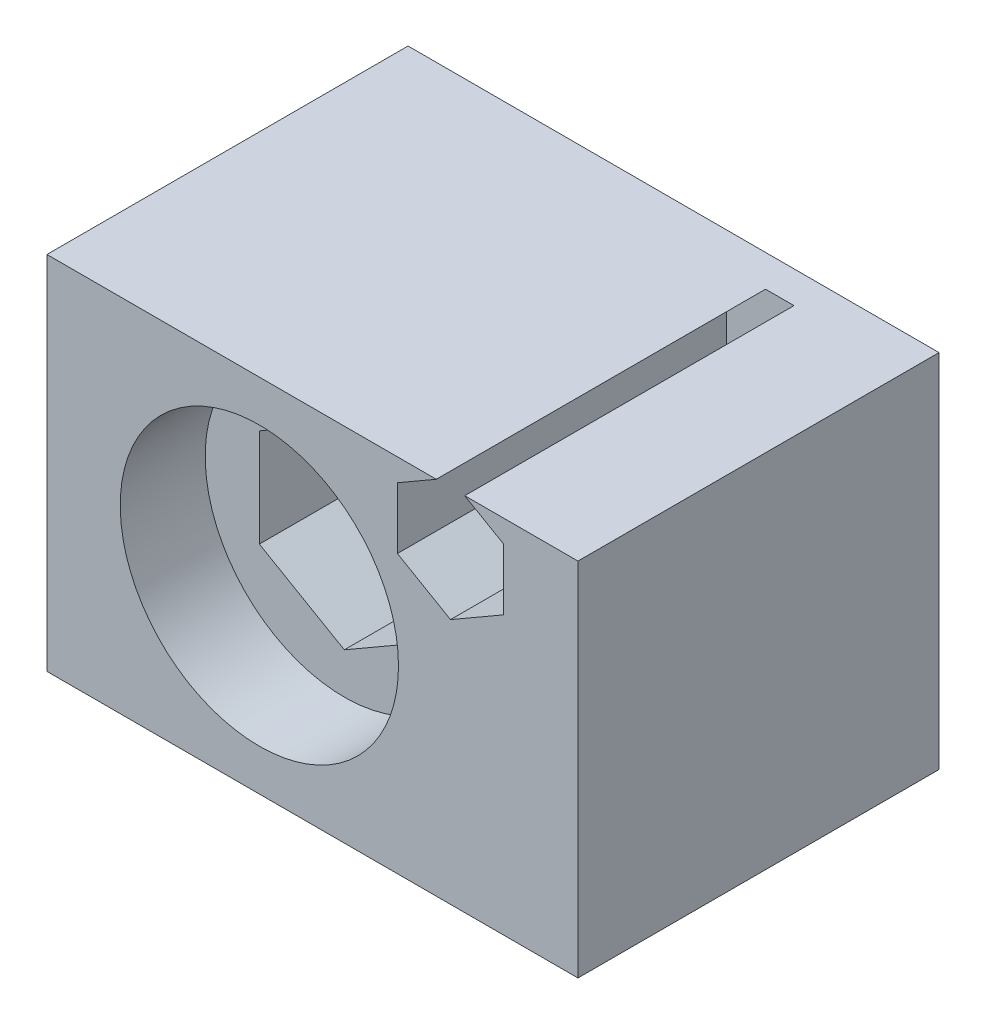
ISO-10303-21;
HEADER;
FILE_DESCRIPTION(('STEP AP214'),'2;1');
FILE_NAME('part.step','',(''),(''),'','','');
FILE_SCHEMA(('AUTOMOTIVE_DESIGN { 1 0 10303 214 1 1 1 1 }'));
ENDSEC;
DATA;
#1=APPLICATION_CONTEXT('core data for automotive mechanical design processes');
#2=APPLICATION_PROTOCOL_DEFINITION('international standard','automotive_design',2000,#1);
#3=PRODUCT_CONTEXT('',#1,'mechanical');
#4=PRODUCT('Part','Part','',(#3));
#5=PRODUCT_RELATED_PRODUCT_CATEGORY('part','',(#4));
#6=PRODUCT_DEFINITION_FORMATION('','',#4);
#7=PRODUCT_DEFINITION_CONTEXT('part definition',#1,'design');
#8=PRODUCT_DEFINITION('design','',#6,#7);
#9=PRODUCT_DEFINITION_SHAPE('','',#8);
#10=(LENGTH_UNIT() NAMED_UNIT(*) SI_UNIT(.MILLI.,.METRE.));
#11=(NAMED_UNIT(*) PLANE_ANGLE_UNIT() SI_UNIT($,.RADIAN.));
#12=(NAMED_UNIT(*) SI_UNIT($,.STERADIAN.) SOLID_ANGLE_UNIT());
#13=UNCERTAINTY_MEASURE_WITH_UNIT(LENGTH_MEASURE(1.E-05),#10,'distance_accuracy_value','');
#14=(GEOMETRIC_REPRESENTATION_CONTEXT(3) GLOBAL_UNCERTAINTY_ASSIGNED_CONTEXT((#13)) GLOBAL_UNIT_ASSIGNED_CONTEXT((#10,
#11,#12)) REPRESENTATION_CONTEXT('',''));
#15=CARTESIAN_POINT('',(0.,0.,0.));
#16=DIRECTION('',(0.,0.,1.));
#17=DIRECTION('',(1.,0.,0.));
#18=AXIS2_PLACEMENT_3D('',#15,#16,#17);
#19=CARTESIAN_POINT('',(10.,9.,-4.5));
#20=DIRECTION('',(0.,0.,1.));
#21=DIRECTION('',(1.,0.,0.));
#22=AXIS2_PLACEMENT_3D('',#19,#20,#21);
#23=CYLINDRICAL_SURFACE('',#22,6.55);
#24=CARTESIAN_POINT('',(10.,9.,-4.5));
#25=DIRECTION('',(0.,0.,1.));
#26=DIRECTION('',(1.,0.,0.));
#27=AXIS2_PLACEMENT_3D('',#24,#25,#26);
#28=CIRCLE('',#27,6.55);
#29=CARTESIAN_POINT('',(16.55,9.,-4.5));
#30=VERTEX_POINT('',#29);
#31=EDGE_CURVE('E283',#30,#30,#28,.T.);
#32=ORIENTED_EDGE('',*,*,#31,.F.);
#33=EDGE_LOOP('',(#32));
#34=FACE_BOUND('',#33,.T.);
#35=CARTESIAN_POINT('',(10.,9.,-0.499999999999999));
#36=DIRECTION('',(0.,0.,1.));
#37=DIRECTION('',(0.,-1.,0.));
#38=AXIS2_PLACEMENT_3D('',#35,#36,#37);
#39=CIRCLE('',#38,6.55);
#40=CARTESIAN_POINT('',(10.,2.45,-0.499999999999997));
#41=VERTEX_POINT('',#40);
#42=EDGE_CURVE('E206',#41,#41,#39,.F.);
#43=ORIENTED_EDGE('',*,*,#42,.F.);
#44=EDGE_LOOP('',(#43));
#45=FACE_BOUND('',#44,.T.);
#46=ADVANCED_FACE('F36',(#34,#45),#23,.F.);
#47=CARTESIAN_POINT('',(10.,9.,-4.5));
#48=DIRECTION('',(0.,0.,1.));
#49=DIRECTION('',(1.,0.,0.));
#50=AXIS2_PLACEMENT_3D('',#47,#48,#49);
#51=PLANE('',#50);
#52=DIRECTION('',(-0.866025403784439,0.5,0.));
#53=VECTOR('',#52,1.);
#54=CARTESIAN_POINT('',(14.,11.3094010767585,-4.5));
#55=LINE('',#54,#53);
#56=CARTESIAN_POINT('',(14.,11.3094010767585,-4.5));
#57=VERTEX_POINT('',#56);
#58=CARTESIAN_POINT('',(10.,13.618802153517,-4.5));
#59=VERTEX_POINT('',#58);
#60=EDGE_CURVE('E230',#57,#59,#55,.T.);
#61=ORIENTED_EDGE('',*,*,#60,.F.);
#62=DIRECTION('',(0.,1.,0.));
#63=VECTOR('',#62,1.);
#64=CARTESIAN_POINT('',(14.,6.6905989232415,-4.5));
#65=LINE('',#64,#63);
#66=CARTESIAN_POINT('',(14.,6.6905989232415,-4.5));
#67=VERTEX_POINT('',#66);
#68=EDGE_CURVE('E267',#67,#57,#65,.T.);
#69=ORIENTED_EDGE('',*,*,#68,.F.);
#70=DIRECTION('',(0.866025403784439,0.5,0.));
#71=VECTOR('',#70,1.);
#72=CARTESIAN_POINT('',(10.,4.381197846483,-4.5));
#73=LINE('',#72,#71);
#74=CARTESIAN_POINT('',(10.,4.381197846483,-4.5));
#75=VERTEX_POINT('',#74);
#76=EDGE_CURVE('E264',#75,#67,#73,.T.);
#77=ORIENTED_EDGE('',*,*,#76,.F.);
#78=DIRECTION('',(0.866025403784439,-0.5,0.));
#79=VECTOR('',#78,1.);
#80=CARTESIAN_POINT('',(6.,6.6905989232415,-4.5));
#81=LINE('',#80,#79);
#82=CARTESIAN_POINT('',(6.,6.6905989232415,-4.5));
#83=VERTEX_POINT('',#82);
#84=EDGE_CURVE('E261',#83,#75,#81,.T.);
#85=ORIENTED_EDGE('',*,*,#84,.F.);
#86=DIRECTION('',(0.,-1.,0.));
#87=VECTOR('',#86,1.);
#88=CARTESIAN_POINT('',(6.,11.3094010767585,-4.5));
#89=LINE('',#88,#87);
#90=CARTESIAN_POINT('',(6.,11.3094010767585,-4.5));
#91=VERTEX_POINT('',#90);
#92=EDGE_CURVE('E258',#91,#83,#89,.T.);
#93=ORIENTED_EDGE('',*,*,#92,.F.);
#94=DIRECTION('',(-0.866025403784438,-0.5,0.));
#95=VECTOR('',#94,1.);
#96=CARTESIAN_POINT('',(10.,13.618802153517,-4.5));
#97=LINE('',#96,#95);
#98=EDGE_CURVE('E255',#59,#91,#97,.T.);
#99=ORIENTED_EDGE('',*,*,#98,.F.);
#100=EDGE_LOOP('',(#61,#69,#77,#85,#93,#99));
#101=FACE_BOUND('',#100,.T.);
#102=ORIENTED_EDGE('',*,*,#31,.T.);
#103=EDGE_LOOP('',(#102));
#104=FACE_BOUND('',#103,.T.);
#105=ADVANCED_FACE('F332',(#101,#104),#51,.T.);
#106=CARTESIAN_POINT('',(14.,11.3094010767585,-30.2202018532156));
#107=DIRECTION('',(0.5,0.866025403784439,0.));
#108=DIRECTION('',(-0.866025403784439,0.5,0.));
#109=AXIS2_PLACEMENT_3D('',#106,#107,#108);
#110=PLANE('',#109);
#111=DIRECTION('',(0.866025403784439,-0.5,0.));
#112=VECTOR('',#111,1.);
#113=CARTESIAN_POINT('',(14.,11.3094010767585,-16.2));
#114=LINE('',#113,#112);
#115=CARTESIAN_POINT('',(10.,13.618802153517,-16.2));
#116=VERTEX_POINT('',#115);
#117=CARTESIAN_POINT('',(14.,11.3094010767585,-16.2));
#118=VERTEX_POINT('',#117);
#119=EDGE_CURVE('E251',#116,#118,#114,.T.);
#120=ORIENTED_EDGE('',*,*,#119,.T.);
#121=DIRECTION('',(0.,0.,1.));
#122=VECTOR('',#121,1.);
#123=CARTESIAN_POINT('',(14.,11.3094010767585,-30.2202018532156));
#124=LINE('',#123,#122);
#125=EDGE_CURVE('E245',#118,#57,#124,.T.);
#126=ORIENTED_EDGE('',*,*,#125,.T.);
#127=ORIENTED_EDGE('',*,*,#60,.T.);
#128=DIRECTION('',(0.,0.,1.));
#129=VECTOR('',#128,1.);
#130=CARTESIAN_POINT('',(10.,13.618802153517,-30.2202018532156));
#131=LINE('',#130,#129);
#132=EDGE_CURVE('E270',#116,#59,#131,.T.);
#133=ORIENTED_EDGE('',*,*,#132,.F.);
#134=EDGE_LOOP('',(#120,#126,#127,#133));
#135=FACE_BOUND('',#134,.T.);
#136=ADVANCED_FACE('F338',(#135),#110,.F.);
#137=CARTESIAN_POINT('',(14.,6.6905989232415,-30.2202018532156));
#138=DIRECTION('',(1.,0.,0.));
#139=DIRECTION('',(0.,0.,-1.));
#140=AXIS2_PLACEMENT_3D('',#137,#138,#139);
#141=PLANE('',#140);
#142=DIRECTION('',(0.,-1.,0.));
#143=VECTOR('',#142,1.);
#144=CARTESIAN_POINT('',(14.,6.6905989232415,-16.2));
#145=LINE('',#144,#143);
#146=CARTESIAN_POINT('',(14.,6.6905989232415,-16.2));
#147=VERTEX_POINT('',#146);
#148=EDGE_CURVE('E249',#118,#147,#145,.T.);
#149=ORIENTED_EDGE('',*,*,#148,.T.);
#150=DIRECTION('',(0.,0.,1.));
#151=VECTOR('',#150,1.);
#152=CARTESIAN_POINT('',(14.,6.6905989232415,-30.2202018532156));
#153=LINE('',#152,#151);
#154=EDGE_CURVE('E272',#147,#67,#153,.T.);
#155=ORIENTED_EDGE('',*,*,#154,.T.);
#156=ORIENTED_EDGE('',*,*,#68,.T.);
#157=ORIENTED_EDGE('',*,*,#125,.F.);
#158=EDGE_LOOP('',(#149,#155,#156,#157));
#159=FACE_BOUND('',#158,.T.);
#160=ADVANCED_FACE('F488',(#159),#141,.F.);
#161=CARTESIAN_POINT('',(10.,4.381197846483,-30.2202018532156));
#162=DIRECTION('',(0.5,-0.866025403784439,0.));
#163=DIRECTION('',(0.866025403784439,0.5,0.));
#164=AXIS2_PLACEMENT_3D('',#161,#162,#163);
#165=PLANE('',#164);
#166=DIRECTION('',(-0.866025403784439,-0.5,0.));
#167=VECTOR('',#166,1.);
#168=CARTESIAN_POINT('',(10.,4.381197846483,-16.2));
#169=LINE('',#168,#167);
#170=CARTESIAN_POINT('',(10.,4.381197846483,-16.2));
#171=VERTEX_POINT('',#170);
#172=EDGE_CURVE('E247',#147,#171,#169,.T.);
#173=ORIENTED_EDGE('',*,*,#172,.T.);
#174=DIRECTION('',(0.,0.,1.));
#175=VECTOR('',#174,1.);
#176=CARTESIAN_POINT('',(10.,4.381197846483,-30.2202018532156));
#177=LINE('',#176,#175);
#178=EDGE_CURVE('E274',#171,#75,#177,.T.);
#179=ORIENTED_EDGE('',*,*,#178,.T.);
#180=ORIENTED_EDGE('',*,*,#76,.T.);
#181=ORIENTED_EDGE('',*,*,#154,.F.);
#182=EDGE_LOOP('',(#173,#179,#180,#181));
#183=FACE_BOUND('',#182,.T.);
#184=ADVANCED_FACE('F480',(#183),#165,.F.);
#185=CARTESIAN_POINT('',(6.,6.6905989232415,-30.2202018532156));
#186=DIRECTION('',(-0.5,-0.866025403784439,0.));
#187=DIRECTION('',(0.866025403784439,-0.5,0.));
#188=AXIS2_PLACEMENT_3D('',#185,#186,#187);
#189=PLANE('',#188);
#190=DIRECTION('',(-0.866025403784439,0.5,0.));
#191=VECTOR('',#190,1.);
#192=CARTESIAN_POINT('',(6.,6.6905989232415,-16.2));
#193=LINE('',#192,#191);
#194=CARTESIAN_POINT('',(6.,6.6905989232415,-16.2));
#195=VERTEX_POINT('',#194);
#196=EDGE_CURVE('E244',#171,#195,#193,.T.);
#197=ORIENTED_EDGE('',*,*,#196,.T.);
#198=DIRECTION('',(0.,0.,1.));
#199=VECTOR('',#198,1.);
#200=CARTESIAN_POINT('',(6.,6.6905989232415,-30.2202018532156));
#201=LINE('',#200,#199);
#202=EDGE_CURVE('E276',#195,#83,#201,.T.);
#203=ORIENTED_EDGE('',*,*,#202,.T.);
#204=ORIENTED_EDGE('',*,*,#84,.T.);
#205=ORIENTED_EDGE('',*,*,#178,.F.);
#206=EDGE_LOOP('',(#197,#203,#204,#205));
#207=FACE_BOUND('',#206,.T.);
#208=ADVANCED_FACE('F472',(#207),#189,.F.);
#209=CARTESIAN_POINT('',(6.,11.3094010767585,-30.2202018532156));
#210=DIRECTION('',(-1.,0.,0.));
#211=DIRECTION('',(0.,0.,1.));
#212=AXIS2_PLACEMENT_3D('',#209,#210,#211);
#213=PLANE('',#212);
#214=DIRECTION('',(0.,1.,0.));
#215=VECTOR('',#214,1.);
#216=CARTESIAN_POINT('',(6.,11.3094010767585,-16.2));
#217=LINE('',#216,#215);
#218=CARTESIAN_POINT('',(6.,11.3094010767585,-16.2));
#219=VERTEX_POINT('',#218);
#220=EDGE_CURVE('E242',#195,#219,#217,.T.);
#221=ORIENTED_EDGE('',*,*,#220,.T.);
#222=DIRECTION('',(0.,0.,1.));
#223=VECTOR('',#222,1.);
#224=CARTESIAN_POINT('',(6.,11.3094010767585,-30.2202018532156));
#225=LINE('',#224,#223);
#226=EDGE_CURVE('E278',#219,#91,#225,.T.);
#227=ORIENTED_EDGE('',*,*,#226,.T.);
#228=ORIENTED_EDGE('',*,*,#92,.T.);
#229=ORIENTED_EDGE('',*,*,#202,.F.);
#230=EDGE_LOOP('',(#221,#227,#228,#229));
#231=FACE_BOUND('',#230,.T.);
#232=ADVANCED_FACE('F465',(#231),#213,.F.);
#233=CARTESIAN_POINT('',(10.,13.618802153517,-30.2202018532156));
#234=DIRECTION('',(-0.5,0.866025403784438,0.));
#235=DIRECTION('',(-0.866025403784438,-0.5,0.));
#236=AXIS2_PLACEMENT_3D('',#233,#234,#235);
#237=PLANE('',#236);
#238=DIRECTION('',(0.866025403784438,0.5,0.));
#239=VECTOR('',#238,1.);
#240=CARTESIAN_POINT('',(10.,13.618802153517,-16.2));
#241=LINE('',#240,#239);
#242=EDGE_CURVE('E253',#219,#116,#241,.T.);
#243=ORIENTED_EDGE('',*,*,#242,.T.);
#244=ORIENTED_EDGE('',*,*,#132,.T.);
#245=ORIENTED_EDGE('',*,*,#98,.T.);
#246=ORIENTED_EDGE('',*,*,#226,.F.);
#247=EDGE_LOOP('',(#243,#244,#245,#246));
#248=FACE_BOUND('',#247,.T.);
#249=ADVANCED_FACE('F457',(#248),#237,.F.);
#250=CARTESIAN_POINT('',(25.,0.,-16.2));
#251=DIRECTION('',(0.,0.,1.));
#252=DIRECTION('',(1.,0.,0.));
#253=AXIS2_PLACEMENT_3D('',#250,#251,#252);
#254=PLANE('',#253);
#255=ORIENTED_EDGE('',*,*,#119,.F.);
#256=ORIENTED_EDGE('',*,*,#242,.F.);
#257=ORIENTED_EDGE('',*,*,#220,.F.);
#258=ORIENTED_EDGE('',*,*,#196,.F.);
#259=ORIENTED_EDGE('',*,*,#172,.F.);
#260=ORIENTED_EDGE('',*,*,#148,.F.);
#261=EDGE_LOOP('',(#255,#256,#257,#258,#259,#260));
#262=FACE_BOUND('',#261,.T.);
#263=ADVANCED_FACE('F437',(#262),#254,.T.);
#264=CARTESIAN_POINT('',(25.,17.5,-0.5));
#265=DIRECTION('',(0.,0.,1.));
#266=DIRECTION('',(0.,-1.,0.));
#267=AXIS2_PLACEMENT_3D('',#264,#265,#266);
#268=PLANE('',#267);
#269=DIRECTION('',(0.866025403784439,-0.5,0.));
#270=VECTOR('',#269,1.);
#271=CARTESIAN_POINT('',(21.5000000000016,16.4433756729741,-0.5));
#272=LINE('',#271,#270);
#273=CARTESIAN_POINT('',(19.6698729810795,17.5,-0.500000000000001));
#274=VERTEX_POINT('',#273);
#275=CARTESIAN_POINT('',(21.5000000000016,16.4433756729741,-0.500000000000001));
#276=VERTEX_POINT('',#275);
#277=EDGE_CURVE('E204',#274,#276,#272,.T.);
#278=ORIENTED_EDGE('',*,*,#277,.T.);
#279=DIRECTION('',(0.,-1.,0.));
#280=VECTOR('',#279,1.);
#281=CARTESIAN_POINT('',(21.5000000000016,13.556624327026,-0.5));
#282=LINE('',#281,#280);
#283=CARTESIAN_POINT('',(21.5000000000016,13.556624327026,-0.499999999999999));
#284=VERTEX_POINT('',#283);
#285=EDGE_CURVE('E202',#276,#284,#282,.T.);
#286=ORIENTED_EDGE('',*,*,#285,.T.);
#287=DIRECTION('',(-0.866025403784438,-0.5,0.));
#288=VECTOR('',#287,1.);
#289=CARTESIAN_POINT('',(19.0000000000016,12.1132486540519,-0.499999999999999));
#290=LINE('',#289,#288);
#291=CARTESIAN_POINT('',(19.0000000000016,12.1132486540519,-0.5));
#292=VERTEX_POINT('',#291);
#293=EDGE_CURVE('E200',#284,#292,#290,.T.);
#294=ORIENTED_EDGE('',*,*,#293,.T.);
#295=DIRECTION('',(-0.866025403784439,0.5,0.));
#296=VECTOR('',#295,1.);
#297=CARTESIAN_POINT('',(16.5000000000016,13.556624327026,-0.5));
#298=LINE('',#297,#296);
#299=CARTESIAN_POINT('',(16.5000000000016,13.556624327026,-0.5));
#300=VERTEX_POINT('',#299);
#301=EDGE_CURVE('E198',#292,#300,#298,.T.);
#302=ORIENTED_EDGE('',*,*,#301,.T.);
#303=DIRECTION('',(0.,1.,0.));
#304=VECTOR('',#303,1.);
#305=CARTESIAN_POINT('',(16.5000000000016,16.4433756729741,-0.5));
#306=LINE('',#305,#304);
#307=CARTESIAN_POINT('',(16.5000000000016,16.4433756729741,-0.5));
#308=VERTEX_POINT('',#307);
#309=EDGE_CURVE('E196',#300,#308,#306,.T.);
#310=ORIENTED_EDGE('',*,*,#309,.T.);
#311=DIRECTION('',(0.866025403784438,0.500000000000001,0.));
#312=VECTOR('',#311,1.);
#313=CARTESIAN_POINT('',(19.0000000000016,17.8867513459482,-0.5));
#314=LINE('',#313,#312);
#315=CARTESIAN_POINT('',(18.3301270189237,17.5,-0.5));
#316=VERTEX_POINT('',#315);
#317=EDGE_CURVE('E12',#308,#316,#314,.T.);
#318=ORIENTED_EDGE('',*,*,#317,.T.);
#319=DIRECTION('',(-1.,0.,0.));
#320=VECTOR('',#319,1.);
#321=CARTESIAN_POINT('',(25.,17.5,-0.5));
#322=LINE('',#321,#320);
#323=CARTESIAN_POINT('',(0.,17.5,-0.5));
#324=VERTEX_POINT('',#323);
#325=EDGE_CURVE('E163',#316,#324,#322,.T.);
#326=ORIENTED_EDGE('',*,*,#325,.T.);
#327=DIRECTION('',(0.,1.,0.));
#328=VECTOR('',#327,1.);
#329=CARTESIAN_POINT('',(0.,17.5,-0.5));
#330=LINE('',#329,#328);
#331=CARTESIAN_POINT('',(0.,0.5,-0.499999999999997));
#332=VERTEX_POINT('',#331);
#333=EDGE_CURVE('E59',#332,#324,#330,.T.);
#334=ORIENTED_EDGE('',*,*,#333,.F.);
#335=DIRECTION('',(-1.,0.,0.));
#336=VECTOR('',#335,1.);
#337=CARTESIAN_POINT('',(25.,0.5,-0.499999999999997));
#338=LINE('',#337,#336);
#339=CARTESIAN_POINT('',(25.,0.5,-0.499999999999997));
#340=VERTEX_POINT('',#339);
#341=EDGE_CURVE('E169',#340,#332,#338,.T.);
#342=ORIENTED_EDGE('',*,*,#341,.F.);
#343=DIRECTION('',(0.,1.,0.));
#344=VECTOR('',#343,1.);
#345=CARTESIAN_POINT('',(25.,17.5,-0.5));
#346=LINE('',#345,#344);
#347=CARTESIAN_POINT('',(25.,17.5,-0.5));
#348=VERTEX_POINT('',#347);
#349=EDGE_CURVE('E166',#340,#348,#346,.T.);
#350=ORIENTED_EDGE('',*,*,#349,.T.);
#351=EDGE_CURVE('E154',#348,#274,#322,.T.);
#352=ORIENTED_EDGE('',*,*,#351,.T.);
#353=EDGE_LOOP('',(#278,#286,#294,#302,#310,#318,#326,#334,#342,#350,#352));
#354=FACE_BOUND('',#353,.T.);
#355=ORIENTED_EDGE('',*,*,#42,.T.);
#356=EDGE_LOOP('',(#355));
#357=FACE_BOUND('',#356,.T.);
#358=ADVANCED_FACE('F167',(#354,#357),#268,.T.);
#359=CARTESIAN_POINT('',(25.,17.5,-17.5));
#360=DIRECTION('',(0.,1.,0.));
#361=DIRECTION('',(0.,0.,1.));
#362=AXIS2_PLACEMENT_3D('',#359,#360,#361);
#363=PLANE('',#362);
#364=DIRECTION('',(0.,0.,1.));
#365=VECTOR('',#364,1.);
#366=CARTESIAN_POINT('',(19.6698729810795,17.5,-16.));
#367=LINE('',#366,#365);
#368=CARTESIAN_POINT('',(19.6698729810795,17.5,-16.));
#369=VERTEX_POINT('',#368);
#370=EDGE_CURVE('E160',#369,#274,#367,.T.);
#371=ORIENTED_EDGE('',*,*,#370,.T.);
#372=ORIENTED_EDGE('',*,*,#351,.F.);
#373=DIRECTION('',(0.,0.,-1.));
#374=VECTOR('',#373,1.);
#375=CARTESIAN_POINT('',(25.,17.5,-17.5));
#376=LINE('',#375,#374);
#377=CARTESIAN_POINT('',(25.,17.5,-17.5));
#378=VERTEX_POINT('',#377);
#379=EDGE_CURVE('E158',#348,#378,#376,.T.);
#380=ORIENTED_EDGE('',*,*,#379,.T.);
#381=DIRECTION('',(-1.,0.,0.));
#382=VECTOR('',#381,1.);
#383=CARTESIAN_POINT('',(25.,17.5,-17.5));
#384=LINE('',#383,#382);
#385=CARTESIAN_POINT('',(0.,17.5,-17.5));
#386=VERTEX_POINT('',#385);
#387=EDGE_CURVE('E162',#378,#386,#384,.T.);
#388=ORIENTED_EDGE('',*,*,#387,.T.);
#389=DIRECTION('',(0.,0.,-1.));
#390=VECTOR('',#389,1.);
#391=CARTESIAN_POINT('',(0.,17.5,-17.5));
#392=LINE('',#391,#390);
#393=EDGE_CURVE('E188',#324,#386,#392,.T.);
#394=ORIENTED_EDGE('',*,*,#393,.F.);
#395=ORIENTED_EDGE('',*,*,#325,.F.);
#396=DIRECTION('',(0.,0.,-1.));
#397=VECTOR('',#396,1.);
#398=CARTESIAN_POINT('',(18.3301270189238,17.5,-16.));
#399=LINE('',#398,#397);
#400=CARTESIAN_POINT('',(18.3301270189238,17.5,-16.));
#401=VERTEX_POINT('',#400);
#402=EDGE_CURVE('E191',#316,#401,#399,.T.);
#403=ORIENTED_EDGE('',*,*,#402,.T.);
#404=DIRECTION('',(-1.,0.,0.));
#405=VECTOR('',#404,1.);
#406=CARTESIAN_POINT('',(0.,17.5,-16.));
#407=LINE('',#406,#405);
#408=EDGE_CURVE('E44',#369,#401,#407,.T.);
#409=ORIENTED_EDGE('',*,*,#408,.F.);
#410=EDGE_LOOP('',(#371,#372,#380,#388,#394,#395,#403,#409));
#411=FACE_BOUND('',#410,.T.);
#412=ADVANCED_FACE('F156',(#411),#363,.T.);
#413=CARTESIAN_POINT('',(25.,17.5,-17.5));
#414=DIRECTION('',(0.,0.,-1.));
#415=DIRECTION('',(0.,1.,0.));
#416=AXIS2_PLACEMENT_3D('',#413,#414,#415);
#417=PLANE('',#416);
#418=DIRECTION('',(0.,-1.,0.));
#419=VECTOR('',#418,1.);
#420=CARTESIAN_POINT('',(0.,17.5,-17.5));
#421=LINE('',#420,#419);
#422=CARTESIAN_POINT('',(0.,0.5,-17.5));
#423=VERTEX_POINT('',#422);
#424=EDGE_CURVE('E181',#386,#423,#421,.T.);
#425=ORIENTED_EDGE('',*,*,#424,.F.);
#426=ORIENTED_EDGE('',*,*,#387,.F.);
#427=DIRECTION('',(0.,-1.,0.));
#428=VECTOR('',#427,1.);
#429=CARTESIAN_POINT('',(25.,17.5,-17.5));
#430=LINE('',#429,#428);
#431=CARTESIAN_POINT('',(25.,0.5,-17.5));
#432=VERTEX_POINT('',#431);
#433=EDGE_CURVE('E51',#378,#432,#430,.T.);
#434=ORIENTED_EDGE('',*,*,#433,.T.);
#435=DIRECTION('',(-1.,0.,0.));
#436=VECTOR('',#435,1.);
#437=CARTESIAN_POINT('',(25.,0.5,-17.5));
#438=LINE('',#437,#436);
#439=EDGE_CURVE('E176',#432,#423,#438,.T.);
#440=ORIENTED_EDGE('',*,*,#439,.T.);
#441=EDGE_LOOP('',(#425,#426,#434,#440));
#442=FACE_BOUND('',#441,.T.);
#443=ADVANCED_FACE('F321',(#442),#417,.T.);
#444=CARTESIAN_POINT('',(25.,0.5,-17.5));
#445=DIRECTION('',(0.,-1.,0.));
#446=DIRECTION('',(0.,0.,-1.));
#447=AXIS2_PLACEMENT_3D('',#444,#445,#446);
#448=PLANE('',#447);
#449=DIRECTION('',(0.,0.,1.));
#450=VECTOR('',#449,1.);
#451=CARTESIAN_POINT('',(0.,0.5,-17.5));
#452=LINE('',#451,#450);
#453=EDGE_CURVE('E184',#423,#332,#452,.T.);
#454=ORIENTED_EDGE('',*,*,#453,.F.);
#455=ORIENTED_EDGE('',*,*,#439,.F.);
#456=DIRECTION('',(0.,0.,1.));
#457=VECTOR('',#456,1.);
#458=CARTESIAN_POINT('',(25.,0.5,-17.5));
#459=LINE('',#458,#457);
#460=EDGE_CURVE('E173',#432,#340,#459,.T.);
#461=ORIENTED_EDGE('',*,*,#460,.T.);
#462=ORIENTED_EDGE('',*,*,#341,.T.);
#463=EDGE_LOOP('',(#454,#455,#461,#462));
#464=FACE_BOUND('',#463,.T.);
#465=ADVANCED_FACE('F319',(#464),#448,.T.);
#466=CARTESIAN_POINT('',(0.,0.,0.));
#467=DIRECTION('',(-1.,0.,0.));
#468=DIRECTION('',(0.,0.,1.));
#469=AXIS2_PLACEMENT_3D('',#466,#467,#468);
#470=PLANE('',#469);
#471=ORIENTED_EDGE('',*,*,#393,.T.);
#472=ORIENTED_EDGE('',*,*,#424,.T.);
#473=ORIENTED_EDGE('',*,*,#453,.T.);
#474=ORIENTED_EDGE('',*,*,#333,.T.);
#475=EDGE_LOOP('',(#471,#472,#473,#474));
#476=FACE_BOUND('',#475,.T.);
#477=ADVANCED_FACE('F38',(#476),#470,.T.);
#478=CARTESIAN_POINT('',(25.,0.,0.));
#479=DIRECTION('',(-1.,0.,0.));
#480=DIRECTION('',(0.,0.,1.));
#481=AXIS2_PLACEMENT_3D('',#478,#479,#480);
#482=PLANE('',#481);
#483=ORIENTED_EDGE('',*,*,#433,.F.);
#484=ORIENTED_EDGE('',*,*,#379,.F.);
#485=ORIENTED_EDGE('',*,*,#349,.F.);
#486=ORIENTED_EDGE('',*,*,#460,.F.);
#487=EDGE_LOOP('',(#483,#484,#485,#486));
#488=FACE_BOUND('',#487,.T.);
#489=ADVANCED_FACE('F175',(#488),#482,.F.);
#490=CARTESIAN_POINT('',(0.,0.,-16.));
#491=DIRECTION('',(0.,0.,1.));
#492=DIRECTION('',(1.,0.,0.));
#493=AXIS2_PLACEMENT_3D('',#490,#491,#492);
#494=PLANE('',#493);
#495=DIRECTION('',(-0.866025403784439,0.5,0.));
#496=VECTOR('',#495,1.);
#497=CARTESIAN_POINT('',(21.5000000000016,16.4433756729741,-16.));
#498=LINE('',#497,#496);
#499=CARTESIAN_POINT('',(21.5000000000016,16.4433756729741,-16.));
#500=VERTEX_POINT('',#499);
#501=EDGE_CURVE('E209',#500,#369,#498,.T.);
#502=ORIENTED_EDGE('',*,*,#501,.T.);
#503=ORIENTED_EDGE('',*,*,#408,.T.);
#504=DIRECTION('',(-0.866025403784438,-0.500000000000001,0.));
#505=VECTOR('',#504,1.);
#506=CARTESIAN_POINT('',(19.0000000000016,17.8867513459482,-16.));
#507=LINE('',#506,#505);
#508=CARTESIAN_POINT('',(16.5000000000016,16.4433756729741,-16.));
#509=VERTEX_POINT('',#508);
#510=EDGE_CURVE('E212',#401,#509,#507,.T.);
#511=ORIENTED_EDGE('',*,*,#510,.T.);
#512=DIRECTION('',(0.,-1.,0.));
#513=VECTOR('',#512,1.);
#514=CARTESIAN_POINT('',(16.5000000000016,16.4433756729741,-16.));
#515=LINE('',#514,#513);
#516=CARTESIAN_POINT('',(16.5000000000016,13.556624327026,-16.));
#517=VERTEX_POINT('',#516);
#518=EDGE_CURVE('E214',#509,#517,#515,.T.);
#519=ORIENTED_EDGE('',*,*,#518,.T.);
#520=DIRECTION('',(0.866025403784439,-0.5,0.));
#521=VECTOR('',#520,1.);
#522=CARTESIAN_POINT('',(16.5000000000016,13.556624327026,-16.));
#523=LINE('',#522,#521);
#524=CARTESIAN_POINT('',(19.0000000000016,12.1132486540519,-16.));
#525=VERTEX_POINT('',#524);
#526=EDGE_CURVE('E217',#517,#525,#523,.T.);
#527=ORIENTED_EDGE('',*,*,#526,.T.);
#528=DIRECTION('',(0.866025403784438,0.5,0.));
#529=VECTOR('',#528,1.);
#530=CARTESIAN_POINT('',(19.0000000000016,12.1132486540519,-16.));
#531=LINE('',#530,#529);
#532=CARTESIAN_POINT('',(21.5000000000016,13.556624327026,-16.));
#533=VERTEX_POINT('',#532);
#534=EDGE_CURVE('E220',#525,#533,#531,.T.);
#535=ORIENTED_EDGE('',*,*,#534,.T.);
#536=DIRECTION('',(0.,1.,0.));
#537=VECTOR('',#536,1.);
#538=CARTESIAN_POINT('',(21.5000000000016,13.556624327026,-16.));
#539=LINE('',#538,#537);
#540=EDGE_CURVE('E223',#533,#500,#539,.T.);
#541=ORIENTED_EDGE('',*,*,#540,.T.);
#542=EDGE_LOOP('',(#502,#503,#511,#519,#527,#535,#541));
#543=FACE_BOUND('',#542,.T.);
#544=ADVANCED_FACE('F288',(#543),#494,.T.);
#545=CARTESIAN_POINT('',(19.0000000000016,17.8867513459482,-16.));
#546=DIRECTION('',(-0.500000000000001,0.866025403784438,0.));
#547=DIRECTION('',(-0.866025403784438,-0.500000000000001,0.));
#548=AXIS2_PLACEMENT_3D('',#545,#546,#547);
#549=PLANE('',#548);
#550=ORIENTED_EDGE('',*,*,#402,.F.);
#551=ORIENTED_EDGE('',*,*,#317,.F.);
#552=DIRECTION('',(0.,0.,1.));
#553=VECTOR('',#552,1.);
#554=CARTESIAN_POINT('',(16.5000000000016,16.4433756729741,-16.));
#555=LINE('',#554,#553);
#556=EDGE_CURVE('E226',#509,#308,#555,.T.);
#557=ORIENTED_EDGE('',*,*,#556,.F.);
#558=ORIENTED_EDGE('',*,*,#510,.F.);
#559=EDGE_LOOP('',(#550,#551,#557,#558));
#560=FACE_BOUND('',#559,.T.);
#561=ADVANCED_FACE('F293',(#560),#549,.F.);
#562=CARTESIAN_POINT('',(16.5000000000016,16.4433756729741,-16.));
#563=DIRECTION('',(-1.,0.,0.));
#564=DIRECTION('',(0.,0.,1.));
#565=AXIS2_PLACEMENT_3D('',#562,#563,#564);
#566=PLANE('',#565);
#567=ORIENTED_EDGE('',*,*,#309,.F.);
#568=DIRECTION('',(0.,0.,1.));
#569=VECTOR('',#568,1.);
#570=CARTESIAN_POINT('',(16.5000000000016,13.556624327026,-16.));
#571=LINE('',#570,#569);
#572=EDGE_CURVE('E237',#517,#300,#571,.T.);
#573=ORIENTED_EDGE('',*,*,#572,.F.);
#574=ORIENTED_EDGE('',*,*,#518,.F.);
#575=ORIENTED_EDGE('',*,*,#556,.T.);
#576=EDGE_LOOP('',(#567,#573,#574,#575));
#577=FACE_BOUND('',#576,.T.);
#578=ADVANCED_FACE('F298',(#577),#566,.F.);
#579=CARTESIAN_POINT('',(16.5000000000016,13.556624327026,-16.));
#580=DIRECTION('',(-0.5,-0.866025403784439,0.));
#581=DIRECTION('',(0.866025403784439,-0.5,0.));
#582=AXIS2_PLACEMENT_3D('',#579,#580,#581);
#583=PLANE('',#582);
#584=ORIENTED_EDGE('',*,*,#301,.F.);
#585=DIRECTION('',(0.,0.,1.));
#586=VECTOR('',#585,1.);
#587=CARTESIAN_POINT('',(19.0000000000016,12.1132486540519,-16.));
#588=LINE('',#587,#586);
#589=EDGE_CURVE('E234',#525,#292,#588,.T.);
#590=ORIENTED_EDGE('',*,*,#589,.F.);
#591=ORIENTED_EDGE('',*,*,#526,.F.);
#592=ORIENTED_EDGE('',*,*,#572,.T.);
#593=EDGE_LOOP('',(#584,#590,#591,#592));
#594=FACE_BOUND('',#593,.T.);
#595=ADVANCED_FACE('F304',(#594),#583,.F.);
#596=CARTESIAN_POINT('',(19.0000000000016,12.1132486540519,-16.));
#597=DIRECTION('',(0.5,-0.866025403784438,0.));
#598=DIRECTION('',(0.866025403784438,0.5,0.));
#599=AXIS2_PLACEMENT_3D('',#596,#597,#598);
#600=PLANE('',#599);
#601=ORIENTED_EDGE('',*,*,#293,.F.);
#602=DIRECTION('',(0.,0.,1.));
#603=VECTOR('',#602,1.);
#604=CARTESIAN_POINT('',(21.5000000000016,13.556624327026,-16.));
#605=LINE('',#604,#603);
#606=EDGE_CURVE('E231',#533,#284,#605,.T.);
#607=ORIENTED_EDGE('',*,*,#606,.F.);
#608=ORIENTED_EDGE('',*,*,#534,.F.);
#609=ORIENTED_EDGE('',*,*,#589,.T.);
#610=EDGE_LOOP('',(#601,#607,#608,#609));
#611=FACE_BOUND('',#610,.T.);
#612=ADVANCED_FACE('F307',(#611),#600,.F.);
#613=CARTESIAN_POINT('',(21.5000000000016,13.556624327026,-16.));
#614=DIRECTION('',(1.,0.,0.));
#615=DIRECTION('',(0.,0.,-1.));
#616=AXIS2_PLACEMENT_3D('',#613,#614,#615);
#617=PLANE('',#616);
#618=ORIENTED_EDGE('',*,*,#285,.F.);
#619=DIRECTION('',(0.,0.,1.));
#620=VECTOR('',#619,1.);
#621=CARTESIAN_POINT('',(21.5000000000016,16.4433756729741,-16.));
#622=LINE('',#621,#620);
#623=EDGE_CURVE('E227',#500,#276,#622,.T.);
#624=ORIENTED_EDGE('',*,*,#623,.F.);
#625=ORIENTED_EDGE('',*,*,#540,.F.);
#626=ORIENTED_EDGE('',*,*,#606,.T.);
#627=EDGE_LOOP('',(#618,#624,#625,#626));
#628=FACE_BOUND('',#627,.T.);
#629=ADVANCED_FACE('F310',(#628),#617,.F.);
#630=CARTESIAN_POINT('',(21.5000000000016,16.4433756729741,-16.));
#631=DIRECTION('',(0.5,0.866025403784439,0.));
#632=DIRECTION('',(-0.866025403784439,0.5,0.));
#633=AXIS2_PLACEMENT_3D('',#630,#631,#632);
#634=PLANE('',#633);
#635=ORIENTED_EDGE('',*,*,#370,.F.);
#636=ORIENTED_EDGE('',*,*,#501,.F.);
#637=ORIENTED_EDGE('',*,*,#623,.T.);
#638=ORIENTED_EDGE('',*,*,#277,.F.);
#639=EDGE_LOOP('',(#635,#636,#637,#638));
#640=FACE_BOUND('',#639,.T.);
#641=ADVANCED_FACE('F312',(#640),#634,.F.);
#642=CLOSED_SHELL('',(#46,#105,#136,#160,#184,#208,#232,#249,#263,#358,#412,#443,#465,#477,#489,
#544,#561,#578,#595,#612,#629,#641));
#643=MANIFOLD_SOLID_BREP('B2',#642);
#644=ADVANCED_BREP_SHAPE_REPRESENTATION('',(#18,#643),#14);
#645=SHAPE_DEFINITION_REPRESENTATION(#9,#644);
ENDSEC;
END-ISO-10303-21;
